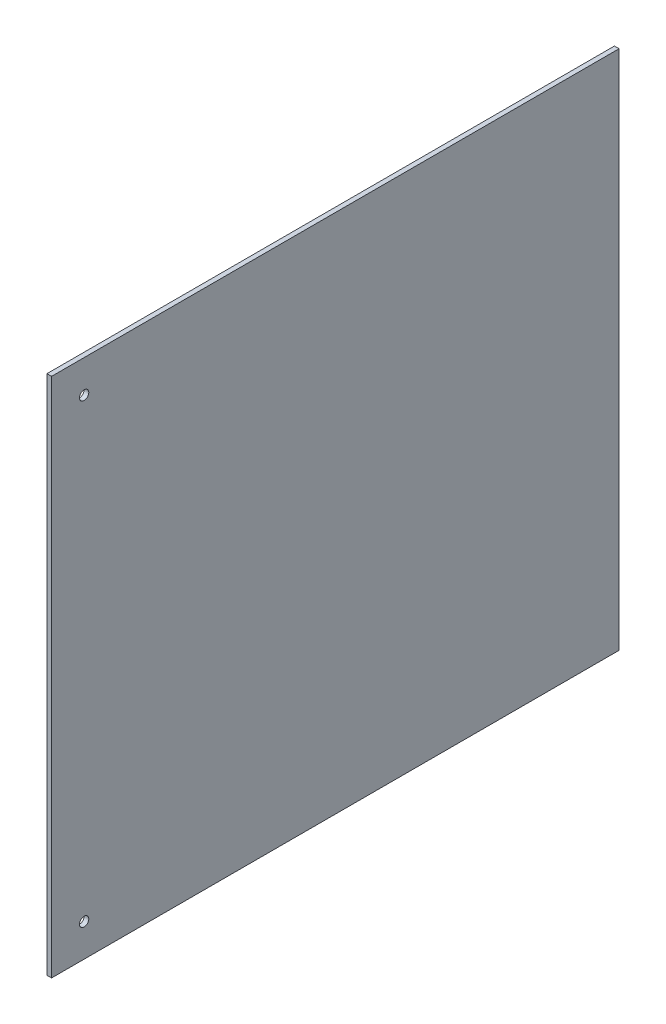
ISO-10303-21;
HEADER;
FILE_DESCRIPTION(('STEP AP214'),'2;1');
FILE_NAME('part.step','',(''),(''),'','','');
FILE_SCHEMA(('AUTOMOTIVE_DESIGN { 1 0 10303 214 1 1 1 1 }'));
ENDSEC;
DATA;
#1=APPLICATION_CONTEXT('core data for automotive mechanical design processes');
#2=APPLICATION_PROTOCOL_DEFINITION('international standard','automotive_design',2000,#1);
#3=PRODUCT_CONTEXT('',#1,'mechanical');
#4=PRODUCT('Part','Part','',(#3));
#5=PRODUCT_RELATED_PRODUCT_CATEGORY('part','',(#4));
#6=PRODUCT_DEFINITION_FORMATION('','',#4);
#7=PRODUCT_DEFINITION_CONTEXT('part definition',#1,'design');
#8=PRODUCT_DEFINITION('design','',#6,#7);
#9=PRODUCT_DEFINITION_SHAPE('','',#8);
#10=(LENGTH_UNIT() NAMED_UNIT(*) SI_UNIT(.MILLI.,.METRE.));
#11=(NAMED_UNIT(*) PLANE_ANGLE_UNIT() SI_UNIT($,.RADIAN.));
#12=(NAMED_UNIT(*) SI_UNIT($,.STERADIAN.) SOLID_ANGLE_UNIT());
#13=UNCERTAINTY_MEASURE_WITH_UNIT(LENGTH_MEASURE(1.E-05),#10,'distance_accuracy_value','');
#14=(GEOMETRIC_REPRESENTATION_CONTEXT(3) GLOBAL_UNCERTAINTY_ASSIGNED_CONTEXT((#13)) GLOBAL_UNIT_ASSIGNED_CONTEXT((#10,
#11,#12)) REPRESENTATION_CONTEXT('',''));
#15=CARTESIAN_POINT('',(0.,0.,0.));
#16=DIRECTION('',(0.,0.,1.));
#17=DIRECTION('',(1.,0.,0.));
#18=AXIS2_PLACEMENT_3D('',#15,#16,#17);
#19=CARTESIAN_POINT('',(662.839573133741,135.480889990023,1327.23113760875));
#20=DIRECTION('',(-1.,0.,0.));
#21=DIRECTION('',(0.,-1.,0.));
#22=AXIS2_PLACEMENT_3D('',#19,#20,#21);
#23=PLANE('',#22);
#24=CARTESIAN_POINT('',(662.839573133741,-20.0941100099767,1498.68113760875));
#25=DIRECTION('',(-1.,0.,0.));
#26=DIRECTION('',(0.,-1.,0.));
#27=AXIS2_PLACEMENT_3D('',#24,#25,#26);
#28=CIRCLE('',#27,3.175);
#29=CARTESIAN_POINT('',(662.839573133741,-23.2691100099767,1498.68113760875));
#30=VERTEX_POINT('',#29);
#31=EDGE_CURVE('E83',#30,#30,#28,.T.);
#32=ORIENTED_EDGE('',*,*,#31,.T.);
#33=EDGE_LOOP('',(#32));
#34=FACE_BOUND('',#33,.T.);
#35=DIRECTION('',(0.,1.,0.));
#36=VECTOR('',#35,1.);
#37=CARTESIAN_POINT('',(662.839573133741,135.480889990023,1520.90613760875));
#38=LINE('',#37,#36);
#39=CARTESIAN_POINT('',(662.839573133741,-42.3191100099771,1520.90613760875));
#40=VERTEX_POINT('',#39);
#41=CARTESIAN_POINT('',(662.839573133741,313.280889990023,1520.90613760875));
#42=VERTEX_POINT('',#41);
#43=EDGE_CURVE('E89',#40,#42,#38,.T.);
#44=ORIENTED_EDGE('',*,*,#43,.F.);
#45=DIRECTION('',(0.,0.,1.));
#46=VECTOR('',#45,1.);
#47=CARTESIAN_POINT('',(662.839573133741,-42.3191100099772,1343.10613760875));
#48=LINE('',#47,#46);
#49=CARTESIAN_POINT('',(662.839573133741,-42.3191100099771,1133.55613760875));
#50=VERTEX_POINT('',#49);
#51=EDGE_CURVE('E60',#40,#50,#48,.F.);
#52=ORIENTED_EDGE('',*,*,#51,.T.);
#53=DIRECTION('',(0.,1.,0.));
#54=VECTOR('',#53,1.);
#55=CARTESIAN_POINT('',(662.839573133741,25.5281988462717,1133.55613760875));
#56=LINE('',#55,#54);
#57=CARTESIAN_POINT('',(662.839573133741,313.280889990023,1133.55613760875));
#58=VERTEX_POINT('',#57);
#59=EDGE_CURVE('E53',#58,#50,#56,.F.);
#60=ORIENTED_EDGE('',*,*,#59,.F.);
#61=DIRECTION('',(0.,0.,1.));
#62=VECTOR('',#61,1.);
#63=CARTESIAN_POINT('',(662.839573133741,313.280889990023,1343.10613760875));
#64=LINE('',#63,#62);
#65=EDGE_CURVE('E58',#42,#58,#64,.F.);
#66=ORIENTED_EDGE('',*,*,#65,.F.);
#67=EDGE_LOOP('',(#44,#52,#60,#66));
#68=FACE_BOUND('',#67,.T.);
#69=CARTESIAN_POINT('',(662.839573133741,291.055889990024,1498.68113760875));
#70=DIRECTION('',(-1.,0.,0.));
#71=DIRECTION('',(0.,-1.,0.));
#72=AXIS2_PLACEMENT_3D('',#69,#70,#71);
#73=CIRCLE('',#72,3.175);
#74=CARTESIAN_POINT('',(662.839573133741,287.880889990024,1498.68113760875));
#75=VERTEX_POINT('',#74);
#76=EDGE_CURVE('E17',#75,#75,#73,.T.);
#77=ORIENTED_EDGE('',*,*,#76,.T.);
#78=EDGE_LOOP('',(#77));
#79=FACE_BOUND('',#78,.T.);
#80=ADVANCED_FACE('F14',(#34,#68,#79),#23,.F.);
#81=CARTESIAN_POINT('',(659.664573133741,291.055889990024,1498.68113760875));
#82=DIRECTION('',(-1.,0.,0.));
#83=DIRECTION('',(0.,-1.,0.));
#84=AXIS2_PLACEMENT_3D('',#81,#82,#83);
#85=CYLINDRICAL_SURFACE('',#84,3.175);
#86=ORIENTED_EDGE('',*,*,#76,.F.);
#87=EDGE_LOOP('',(#86));
#88=FACE_BOUND('',#87,.T.);
#89=CARTESIAN_POINT('',(659.664573133741,291.055889990024,1498.68113760875));
#90=DIRECTION('',(-1.,0.,0.));
#91=DIRECTION('',(0.,-1.,0.));
#92=AXIS2_PLACEMENT_3D('',#89,#90,#91);
#93=CIRCLE('',#92,3.175);
#94=CARTESIAN_POINT('',(659.664573133741,287.880889990024,1498.68113760875));
#95=VERTEX_POINT('',#94);
#96=EDGE_CURVE('E80',#95,#95,#93,.F.);
#97=ORIENTED_EDGE('',*,*,#96,.F.);
#98=EDGE_LOOP('',(#97));
#99=FACE_BOUND('',#98,.T.);
#100=ADVANCED_FACE('F110',(#88,#99),#85,.F.);
#101=CARTESIAN_POINT('',(659.664573133741,313.280889990023,1343.10613760875));
#102=DIRECTION('',(0.,1.,0.));
#103=DIRECTION('',(0.,0.,1.));
#104=AXIS2_PLACEMENT_3D('',#101,#102,#103);
#105=PLANE('',#104);
#106=DIRECTION('',(0.,0.,1.));
#107=VECTOR('',#106,1.);
#108=CARTESIAN_POINT('',(659.664573133741,313.280889990023,1327.23113760875));
#109=LINE('',#108,#107);
#110=CARTESIAN_POINT('',(659.664573133741,313.280889990023,1520.90613760875));
#111=VERTEX_POINT('',#110);
#112=CARTESIAN_POINT('',(659.664573133741,313.280889990023,1133.55613760875));
#113=VERTEX_POINT('',#112);
#114=EDGE_CURVE('E82',#111,#113,#109,.F.);
#115=ORIENTED_EDGE('',*,*,#114,.F.);
#116=DIRECTION('',(1.,0.,0.));
#117=VECTOR('',#116,1.);
#118=CARTESIAN_POINT('',(659.664573133741,313.280889990023,1520.90613760875));
#119=LINE('',#118,#117);
#120=EDGE_CURVE('E68',#42,#111,#119,.F.);
#121=ORIENTED_EDGE('',*,*,#120,.F.);
#122=ORIENTED_EDGE('',*,*,#65,.T.);
#123=DIRECTION('',(-1.,0.,0.));
#124=VECTOR('',#123,1.);
#125=CARTESIAN_POINT('',(659.664573133741,313.280889990023,1133.55613760875));
#126=LINE('',#125,#124);
#127=EDGE_CURVE('E62',#113,#58,#126,.F.);
#128=ORIENTED_EDGE('',*,*,#127,.F.);
#129=EDGE_LOOP('',(#115,#121,#122,#128));
#130=FACE_BOUND('',#129,.T.);
#131=ADVANCED_FACE('F65',(#130),#105,.T.);
#132=CARTESIAN_POINT('',(659.664573133741,25.5281988462717,1133.55613760875));
#133=DIRECTION('',(0.,0.,-1.));
#134=DIRECTION('',(-1.,0.,0.));
#135=AXIS2_PLACEMENT_3D('',#132,#133,#134);
#136=PLANE('',#135);
#137=DIRECTION('',(0.,-1.,0.));
#138=VECTOR('',#137,1.);
#139=CARTESIAN_POINT('',(659.664573133741,135.480889990023,1133.55613760875));
#140=LINE('',#139,#138);
#141=CARTESIAN_POINT('',(659.664573133741,-42.3191100099771,1133.55613760875));
#142=VERTEX_POINT('',#141);
#143=EDGE_CURVE('E73',#113,#142,#140,.T.);
#144=ORIENTED_EDGE('',*,*,#143,.F.);
#145=ORIENTED_EDGE('',*,*,#127,.T.);
#146=ORIENTED_EDGE('',*,*,#59,.T.);
#147=DIRECTION('',(-1.,0.,0.));
#148=VECTOR('',#147,1.);
#149=CARTESIAN_POINT('',(659.664573133741,-42.3191100099772,1133.55613760875));
#150=LINE('',#149,#148);
#151=EDGE_CURVE('E75',#50,#142,#150,.T.);
#152=ORIENTED_EDGE('',*,*,#151,.T.);
#153=EDGE_LOOP('',(#144,#145,#146,#152));
#154=FACE_BOUND('',#153,.T.);
#155=ADVANCED_FACE('F71',(#154),#136,.T.);
#156=CARTESIAN_POINT('',(659.664573133741,-42.3191100099772,1343.10613760875));
#157=DIRECTION('',(0.,1.,0.));
#158=DIRECTION('',(-1.,0.,0.));
#159=AXIS2_PLACEMENT_3D('',#156,#157,#158);
#160=PLANE('',#159);
#161=DIRECTION('',(1.,0.,0.));
#162=VECTOR('',#161,1.);
#163=CARTESIAN_POINT('',(659.664573133741,-42.3191100099772,1520.90613760875));
#164=LINE('',#163,#162);
#165=CARTESIAN_POINT('',(659.664573133741,-42.3191100099772,1520.90613760875));
#166=VERTEX_POINT('',#165);
#167=EDGE_CURVE('E32',#166,#40,#164,.T.);
#168=ORIENTED_EDGE('',*,*,#167,.F.);
#169=DIRECTION('',(0.,0.,1.));
#170=VECTOR('',#169,1.);
#171=CARTESIAN_POINT('',(659.664573133741,-42.319110009977,1327.23113760875));
#172=LINE('',#171,#170);
#173=EDGE_CURVE('E98',#142,#166,#172,.T.);
#174=ORIENTED_EDGE('',*,*,#173,.F.);
#175=ORIENTED_EDGE('',*,*,#151,.F.);
#176=ORIENTED_EDGE('',*,*,#51,.F.);
#177=EDGE_LOOP('',(#168,#174,#175,#176));
#178=FACE_BOUND('',#177,.T.);
#179=ADVANCED_FACE('F96',(#178),#160,.F.);
#180=CARTESIAN_POINT('',(659.664573133741,135.480889990023,1520.90613760875));
#181=DIRECTION('',(0.,0.,1.));
#182=DIRECTION('',(1.,0.,0.));
#183=AXIS2_PLACEMENT_3D('',#180,#181,#182);
#184=PLANE('',#183);
#185=DIRECTION('',(0.,-1.,0.));
#186=VECTOR('',#185,1.);
#187=CARTESIAN_POINT('',(659.664573133741,135.480889990023,1520.90613760875));
#188=LINE('',#187,#186);
#189=EDGE_CURVE('E23',#166,#111,#188,.F.);
#190=ORIENTED_EDGE('',*,*,#189,.F.);
#191=ORIENTED_EDGE('',*,*,#167,.T.);
#192=ORIENTED_EDGE('',*,*,#43,.T.);
#193=ORIENTED_EDGE('',*,*,#120,.T.);
#194=EDGE_LOOP('',(#190,#191,#192,#193));
#195=FACE_BOUND('',#194,.T.);
#196=ADVANCED_FACE('F94',(#195),#184,.T.);
#197=CARTESIAN_POINT('',(659.664573133741,-20.0941100099767,1498.68113760875));
#198=DIRECTION('',(-1.,0.,0.));
#199=DIRECTION('',(0.,-1.,0.));
#200=AXIS2_PLACEMENT_3D('',#197,#198,#199);
#201=CYLINDRICAL_SURFACE('',#200,3.175);
#202=ORIENTED_EDGE('',*,*,#31,.F.);
#203=EDGE_LOOP('',(#202));
#204=FACE_BOUND('',#203,.T.);
#205=CARTESIAN_POINT('',(659.664573133741,-20.0941100099767,1498.68113760875));
#206=DIRECTION('',(-1.,0.,0.));
#207=DIRECTION('',(0.,-1.,0.));
#208=AXIS2_PLACEMENT_3D('',#205,#206,#207);
#209=CIRCLE('',#208,3.175);
#210=CARTESIAN_POINT('',(659.664573133741,-23.2691100099767,1498.68113760875));
#211=VERTEX_POINT('',#210);
#212=EDGE_CURVE('E9',#211,#211,#209,.F.);
#213=ORIENTED_EDGE('',*,*,#212,.F.);
#214=EDGE_LOOP('',(#213));
#215=FACE_BOUND('',#214,.T.);
#216=ADVANCED_FACE('F105',(#204,#215),#201,.F.);
#217=CARTESIAN_POINT('',(659.664573133741,135.480889990023,1327.23113760875));
#218=DIRECTION('',(-1.,0.,0.));
#219=DIRECTION('',(0.,-1.,0.));
#220=AXIS2_PLACEMENT_3D('',#217,#218,#219);
#221=PLANE('',#220);
#222=ORIENTED_EDGE('',*,*,#212,.T.);
#223=EDGE_LOOP('',(#222));
#224=FACE_BOUND('',#223,.T.);
#225=ORIENTED_EDGE('',*,*,#173,.T.);
#226=ORIENTED_EDGE('',*,*,#189,.T.);
#227=ORIENTED_EDGE('',*,*,#114,.T.);
#228=ORIENTED_EDGE('',*,*,#143,.T.);
#229=EDGE_LOOP('',(#225,#226,#227,#228));
#230=FACE_BOUND('',#229,.T.);
#231=ORIENTED_EDGE('',*,*,#96,.T.);
#232=EDGE_LOOP('',(#231));
#233=FACE_BOUND('',#232,.T.);
#234=ADVANCED_FACE('F101',(#224,#230,#233),#221,.T.);
#235=CLOSED_SHELL('',(#80,#100,#131,#155,#179,#196,#216,#234));
#236=MANIFOLD_SOLID_BREP('B1',#235);
#237=ADVANCED_BREP_SHAPE_REPRESENTATION('',(#18,#236),#14);
#238=SHAPE_DEFINITION_REPRESENTATION(#9,#237);
ENDSEC;
END-ISO-10303-21;
